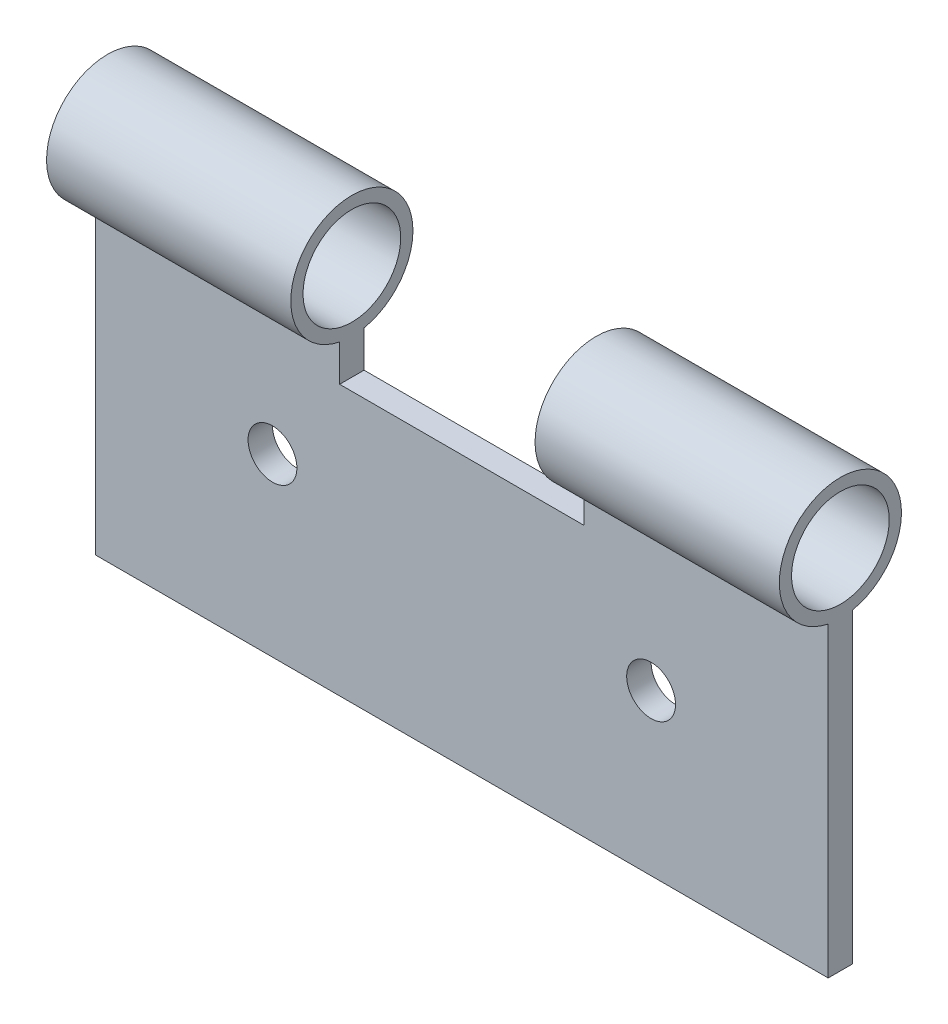
ISO-10303-21;
HEADER;
FILE_DESCRIPTION(('STEP AP214'),'2;1');
FILE_NAME('part.step','',(''),(''),'','','');
FILE_SCHEMA(('AUTOMOTIVE_DESIGN { 1 0 10303 214 1 1 1 1 }'));
ENDSEC;
DATA;
#1=APPLICATION_CONTEXT('core data for automotive mechanical design processes');
#2=APPLICATION_PROTOCOL_DEFINITION('international standard','automotive_design',2000,#1);
#3=PRODUCT_CONTEXT('',#1,'mechanical');
#4=PRODUCT('Part','Part','',(#3));
#5=PRODUCT_RELATED_PRODUCT_CATEGORY('part','',(#4));
#6=PRODUCT_DEFINITION_FORMATION('','',#4);
#7=PRODUCT_DEFINITION_CONTEXT('part definition',#1,'design');
#8=PRODUCT_DEFINITION('design','',#6,#7);
#9=PRODUCT_DEFINITION_SHAPE('','',#8);
#10=(LENGTH_UNIT() NAMED_UNIT(*) SI_UNIT(.MILLI.,.METRE.));
#11=(NAMED_UNIT(*) PLANE_ANGLE_UNIT() SI_UNIT($,.RADIAN.));
#12=(NAMED_UNIT(*) SI_UNIT($,.STERADIAN.) SOLID_ANGLE_UNIT());
#13=UNCERTAINTY_MEASURE_WITH_UNIT(LENGTH_MEASURE(1.E-05),#10,'distance_accuracy_value','');
#14=(GEOMETRIC_REPRESENTATION_CONTEXT(3) GLOBAL_UNCERTAINTY_ASSIGNED_CONTEXT((#13)) GLOBAL_UNIT_ASSIGNED_CONTEXT((#10,
#11,#12)) REPRESENTATION_CONTEXT('',''));
#15=CARTESIAN_POINT('',(0.,0.,0.));
#16=DIRECTION('',(0.,0.,1.));
#17=DIRECTION('',(1.,0.,0.));
#18=AXIS2_PLACEMENT_3D('',#15,#16,#17);
#19=CARTESIAN_POINT('',(3.,0.75,0.));
#20=DIRECTION('',(-1.,0.,0.));
#21=DIRECTION('',(0.,0.,1.));
#22=AXIS2_PLACEMENT_3D('',#19,#20,#21);
#23=CYLINDRICAL_SURFACE('',#22,0.25);
#24=CARTESIAN_POINT('',(2.,0.75,0.));
#25=DIRECTION('',(-1.,0.,0.));
#26=DIRECTION('',(0.,0.,1.));
#27=AXIS2_PLACEMENT_3D('',#24,#25,#26);
#28=CIRCLE('',#27,0.25);
#29=CARTESIAN_POINT('',(2.,0.505051025721682,0.0500000000000001));
#30=VERTEX_POINT('',#29);
#31=CARTESIAN_POINT('',(2.,0.505051025721682,-0.0499999999999999));
#32=VERTEX_POINT('',#31);
#33=EDGE_CURVE('E106',#30,#32,#28,.T.);
#34=ORIENTED_EDGE('',*,*,#33,.F.);
#35=DIRECTION('',(-1.,0.,0.));
#36=VECTOR('',#35,1.);
#37=CARTESIAN_POINT('',(3.,0.505051025721682,0.0500000000000001));
#38=LINE('',#37,#36);
#39=CARTESIAN_POINT('',(3.,0.505051025721682,0.0500000000000001));
#40=VERTEX_POINT('',#39);
#41=EDGE_CURVE('E162',#40,#30,#38,.T.);
#42=ORIENTED_EDGE('',*,*,#41,.F.);
#43=CARTESIAN_POINT('',(3.,0.75,0.));
#44=DIRECTION('',(1.,0.,0.));
#45=DIRECTION('',(0.,0.,-1.));
#46=AXIS2_PLACEMENT_3D('',#43,#44,#45);
#47=CIRCLE('',#46,0.25);
#48=CARTESIAN_POINT('',(3.,0.505051025721682,-0.0499999999999999));
#49=VERTEX_POINT('',#48);
#50=EDGE_CURVE('E83',#49,#40,#47,.T.);
#51=ORIENTED_EDGE('',*,*,#50,.F.);
#52=DIRECTION('',(-1.,0.,0.));
#53=VECTOR('',#52,1.);
#54=CARTESIAN_POINT('',(3.,0.505051025721682,-0.0499999999999999));
#55=LINE('',#54,#53);
#56=EDGE_CURVE('E38',#49,#32,#55,.T.);
#57=ORIENTED_EDGE('',*,*,#56,.T.);
#58=EDGE_LOOP('',(#34,#42,#51,#57));
#59=FACE_BOUND('',#58,.T.);
#60=ADVANCED_FACE('F30',(#59),#23,.T.);
#61=CARTESIAN_POINT('',(3.,0.75,0.));
#62=DIRECTION('',(-1.,0.,0.));
#63=DIRECTION('',(0.,0.,1.));
#64=AXIS2_PLACEMENT_3D('',#61,#62,#63);
#65=CYLINDRICAL_SURFACE('',#64,0.2);
#66=CARTESIAN_POINT('',(3.,0.75,0.));
#67=DIRECTION('',(1.,0.,0.));
#68=DIRECTION('',(0.,0.,-1.));
#69=AXIS2_PLACEMENT_3D('',#66,#67,#68);
#70=CIRCLE('',#69,0.2);
#71=CARTESIAN_POINT('',(3.,0.75,-0.2));
#72=VERTEX_POINT('',#71);
#73=EDGE_CURVE('E136',#72,#72,#70,.T.);
#74=ORIENTED_EDGE('',*,*,#73,.T.);
#75=EDGE_LOOP('',(#74));
#76=FACE_BOUND('',#75,.T.);
#77=CARTESIAN_POINT('',(2.,0.75,0.));
#78=DIRECTION('',(-1.,0.,0.));
#79=DIRECTION('',(0.,0.,1.));
#80=AXIS2_PLACEMENT_3D('',#77,#78,#79);
#81=CIRCLE('',#80,0.2);
#82=CARTESIAN_POINT('',(2.,0.75,0.2));
#83=VERTEX_POINT('',#82);
#84=EDGE_CURVE('E171',#83,#83,#81,.T.);
#85=ORIENTED_EDGE('',*,*,#84,.T.);
#86=EDGE_LOOP('',(#85));
#87=FACE_BOUND('',#86,.T.);
#88=ADVANCED_FACE('F207',(#76,#87),#65,.F.);
#89=CARTESIAN_POINT('',(3.,0.75,0.));
#90=DIRECTION('',(1.,0.,0.));
#91=DIRECTION('',(0.,0.,-1.));
#92=AXIS2_PLACEMENT_3D('',#89,#90,#91);
#93=PLANE('',#92);
#94=DIRECTION('',(0.,1.,0.));
#95=VECTOR('',#94,1.);
#96=CARTESIAN_POINT('',(3.,0.505051025721682,-0.0499999999999999));
#97=LINE('',#96,#95);
#98=CARTESIAN_POINT('',(3.,-0.75,-0.0500000000000001));
#99=VERTEX_POINT('',#98);
#100=EDGE_CURVE('E143',#99,#49,#97,.T.);
#101=ORIENTED_EDGE('',*,*,#100,.T.);
#102=ORIENTED_EDGE('',*,*,#50,.T.);
#103=DIRECTION('',(0.,-1.,0.));
#104=VECTOR('',#103,1.);
#105=CARTESIAN_POINT('',(3.,0.505051025721682,0.0500000000000001));
#106=LINE('',#105,#104);
#107=CARTESIAN_POINT('',(3.,-0.75,0.0499999999999999));
#108=VERTEX_POINT('',#107);
#109=EDGE_CURVE('E146',#40,#108,#106,.T.);
#110=ORIENTED_EDGE('',*,*,#109,.T.);
#111=DIRECTION('',(0.,0.,-1.));
#112=VECTOR('',#111,1.);
#113=CARTESIAN_POINT('',(3.,-0.75,0.0499999999999999));
#114=LINE('',#113,#112);
#115=EDGE_CURVE('E54',#108,#99,#114,.T.);
#116=ORIENTED_EDGE('',*,*,#115,.T.);
#117=EDGE_LOOP('',(#101,#102,#110,#116));
#118=FACE_BOUND('',#117,.T.);
#119=ORIENTED_EDGE('',*,*,#73,.F.);
#120=EDGE_LOOP('',(#119));
#121=FACE_BOUND('',#120,.T.);
#122=ADVANCED_FACE('F192',(#118,#121),#93,.T.);
#123=CARTESIAN_POINT('',(0.,0.75,0.));
#124=DIRECTION('',(1.,0.,0.));
#125=DIRECTION('',(0.,0.,-1.));
#126=AXIS2_PLACEMENT_3D('',#123,#124,#125);
#127=PLANE('',#126);
#128=DIRECTION('',(0.,1.,0.));
#129=VECTOR('',#128,1.);
#130=CARTESIAN_POINT('',(0.,0.505051025721682,-0.0499999999999999));
#131=LINE('',#130,#129);
#132=CARTESIAN_POINT('',(0.,-0.75,-0.0500000000000001));
#133=VERTEX_POINT('',#132);
#134=CARTESIAN_POINT('',(0.,0.505051025721682,-0.0499999999999999));
#135=VERTEX_POINT('',#134);
#136=EDGE_CURVE('E139',#133,#135,#131,.T.);
#137=ORIENTED_EDGE('',*,*,#136,.F.);
#138=DIRECTION('',(0.,0.,-1.));
#139=VECTOR('',#138,1.);
#140=CARTESIAN_POINT('',(0.,-0.75,0.0499999999999999));
#141=LINE('',#140,#139);
#142=CARTESIAN_POINT('',(0.,-0.75,0.0499999999999999));
#143=VERTEX_POINT('',#142);
#144=EDGE_CURVE('E75',#143,#133,#141,.T.);
#145=ORIENTED_EDGE('',*,*,#144,.F.);
#146=DIRECTION('',(0.,-1.,0.));
#147=VECTOR('',#146,1.);
#148=CARTESIAN_POINT('',(0.,0.505051025721682,0.0500000000000001));
#149=LINE('',#148,#147);
#150=CARTESIAN_POINT('',(0.,0.505051025721682,0.0500000000000001));
#151=VERTEX_POINT('',#150);
#152=EDGE_CURVE('E155',#151,#143,#149,.T.);
#153=ORIENTED_EDGE('',*,*,#152,.F.);
#154=CARTESIAN_POINT('',(0.,0.75,0.));
#155=DIRECTION('',(1.,0.,0.));
#156=DIRECTION('',(0.,0.,-1.));
#157=AXIS2_PLACEMENT_3D('',#154,#155,#156);
#158=CIRCLE('',#157,0.25);
#159=EDGE_CURVE('E152',#135,#151,#158,.T.);
#160=ORIENTED_EDGE('',*,*,#159,.F.);
#161=EDGE_LOOP('',(#137,#145,#153,#160));
#162=FACE_BOUND('',#161,.T.);
#163=CARTESIAN_POINT('',(0.,0.75,0.));
#164=DIRECTION('',(1.,0.,0.));
#165=DIRECTION('',(0.,0.,-1.));
#166=AXIS2_PLACEMENT_3D('',#163,#164,#165);
#167=CIRCLE('',#166,0.2);
#168=CARTESIAN_POINT('',(0.,0.75,-0.2));
#169=VERTEX_POINT('',#168);
#170=EDGE_CURVE('E140',#169,#169,#167,.T.);
#171=ORIENTED_EDGE('',*,*,#170,.T.);
#172=EDGE_LOOP('',(#171));
#173=FACE_BOUND('',#172,.T.);
#174=ADVANCED_FACE('F222',(#162,#173),#127,.F.);
#175=CARTESIAN_POINT('',(3.,0.505051025721682,-0.0499999999999999));
#176=DIRECTION('',(0.,0.,1.));
#177=DIRECTION('',(0.,-1.,0.));
#178=AXIS2_PLACEMENT_3D('',#175,#176,#177);
#179=PLANE('',#178);
#180=CARTESIAN_POINT('',(0.725,-0.0295980010586301,-0.05));
#181=DIRECTION('',(0.,0.,-1.));
#182=DIRECTION('',(0.,1.,0.));
#183=AXIS2_PLACEMENT_3D('',#180,#181,#182);
#184=CIRCLE('',#183,0.1);
#185=CARTESIAN_POINT('',(0.725,0.07040199894137,-0.05));
#186=VERTEX_POINT('',#185);
#187=EDGE_CURVE('E123',#186,#186,#184,.T.);
#188=ORIENTED_EDGE('',*,*,#187,.F.);
#189=EDGE_LOOP('',(#188));
#190=FACE_BOUND('',#189,.T.);
#191=CARTESIAN_POINT('',(2.275,-0.0928764860805288,-0.05));
#192=DIRECTION('',(0.,0.,-1.));
#193=DIRECTION('',(0.,1.,0.));
#194=AXIS2_PLACEMENT_3D('',#191,#192,#193);
#195=CIRCLE('',#194,0.0999999999999999);
#196=CARTESIAN_POINT('',(2.275,0.00712351391947105,-0.05));
#197=VERTEX_POINT('',#196);
#198=EDGE_CURVE('E132',#197,#197,#195,.T.);
#199=ORIENTED_EDGE('',*,*,#198,.F.);
#200=EDGE_LOOP('',(#199));
#201=FACE_BOUND('',#200,.T.);
#202=CARTESIAN_POINT('',(1.,0.505051025721682,-0.0499999999999999));
#203=VERTEX_POINT('',#202);
#204=EDGE_CURVE('E165',#203,#135,#55,.T.);
#205=ORIENTED_EDGE('',*,*,#204,.F.);
#206=DIRECTION('',(0.,-1.,0.));
#207=VECTOR('',#206,1.);
#208=CARTESIAN_POINT('',(1.,0.505051025721682,-0.0499999999999999));
#209=LINE('',#208,#207);
#210=CARTESIAN_POINT('',(1.,0.355051025721683,-0.0500000000000001));
#211=VERTEX_POINT('',#210);
#212=EDGE_CURVE('E122',#203,#211,#209,.T.);
#213=ORIENTED_EDGE('',*,*,#212,.T.);
#214=DIRECTION('',(1.,0.,0.));
#215=VECTOR('',#214,1.);
#216=CARTESIAN_POINT('',(3.,0.355051025721683,-0.05));
#217=LINE('',#216,#215);
#218=CARTESIAN_POINT('',(2.,0.355051025721683,-0.0500000000000001));
#219=VERTEX_POINT('',#218);
#220=EDGE_CURVE('E115',#211,#219,#217,.T.);
#221=ORIENTED_EDGE('',*,*,#220,.T.);
#222=DIRECTION('',(0.,-1.,0.));
#223=VECTOR('',#222,1.);
#224=CARTESIAN_POINT('',(2.,0.505051025721682,-0.0499999999999999));
#225=LINE('',#224,#223);
#226=EDGE_CURVE('E103',#32,#219,#225,.T.);
#227=ORIENTED_EDGE('',*,*,#226,.F.);
#228=ORIENTED_EDGE('',*,*,#56,.F.);
#229=ORIENTED_EDGE('',*,*,#100,.F.);
#230=DIRECTION('',(-1.,0.,0.));
#231=VECTOR('',#230,1.);
#232=CARTESIAN_POINT('',(3.,-0.75,-0.0500000000000001));
#233=LINE('',#232,#231);
#234=EDGE_CURVE('E149',#99,#133,#233,.T.);
#235=ORIENTED_EDGE('',*,*,#234,.T.);
#236=ORIENTED_EDGE('',*,*,#136,.T.);
#237=EDGE_LOOP('',(#205,#213,#221,#227,#228,#229,#235,#236));
#238=FACE_BOUND('',#237,.T.);
#239=ADVANCED_FACE('F32',(#190,#201,#238),#179,.F.);
#240=CARTESIAN_POINT('',(1.,0.505051025721682,0.0500000000000001));
#241=VERTEX_POINT('',#240);
#242=EDGE_CURVE('E161',#241,#151,#38,.T.);
#243=ORIENTED_EDGE('',*,*,#242,.F.);
#244=CARTESIAN_POINT('',(1.,0.75,0.));
#245=DIRECTION('',(-1.,0.,0.));
#246=DIRECTION('',(0.,0.,1.));
#247=AXIS2_PLACEMENT_3D('',#244,#245,#246);
#248=CIRCLE('',#247,0.25);
#249=EDGE_CURVE('E128',#241,#203,#248,.T.);
#250=ORIENTED_EDGE('',*,*,#249,.T.);
#251=ORIENTED_EDGE('',*,*,#204,.T.);
#252=ORIENTED_EDGE('',*,*,#159,.T.);
#253=EDGE_LOOP('',(#243,#250,#251,#252));
#254=FACE_BOUND('',#253,.T.);
#255=ADVANCED_FACE('F208',(#254),#23,.T.);
#256=CARTESIAN_POINT('',(3.,0.505051025721682,0.0500000000000001));
#257=DIRECTION('',(0.,0.,-1.));
#258=DIRECTION('',(0.,1.,0.));
#259=AXIS2_PLACEMENT_3D('',#256,#257,#258);
#260=PLANE('',#259);
#261=CARTESIAN_POINT('',(0.725,-0.0295980010586301,0.0500000000000001));
#262=DIRECTION('',(0.,0.,-1.));
#263=DIRECTION('',(0.,1.,0.));
#264=AXIS2_PLACEMENT_3D('',#261,#262,#263);
#265=CIRCLE('',#264,0.1);
#266=CARTESIAN_POINT('',(0.725,0.07040199894137,0.0500000000000001));
#267=VERTEX_POINT('',#266);
#268=EDGE_CURVE('E126',#267,#267,#265,.T.);
#269=ORIENTED_EDGE('',*,*,#268,.T.);
#270=EDGE_LOOP('',(#269));
#271=FACE_BOUND('',#270,.T.);
#272=CARTESIAN_POINT('',(2.275,-0.0928764860805289,0.0500000000000001));
#273=DIRECTION('',(0.,0.,-1.));
#274=DIRECTION('',(0.,1.,0.));
#275=AXIS2_PLACEMENT_3D('',#272,#273,#274);
#276=CIRCLE('',#275,0.0999999999999999);
#277=CARTESIAN_POINT('',(2.275,0.00712351391947103,0.0500000000000001));
#278=VERTEX_POINT('',#277);
#279=EDGE_CURVE('E135',#278,#278,#276,.T.);
#280=ORIENTED_EDGE('',*,*,#279,.T.);
#281=EDGE_LOOP('',(#280));
#282=FACE_BOUND('',#281,.T.);
#283=DIRECTION('',(-1.,0.,0.));
#284=VECTOR('',#283,1.);
#285=CARTESIAN_POINT('',(3.,0.355051025721683,0.0500000000000001));
#286=LINE('',#285,#284);
#287=CARTESIAN_POINT('',(2.,0.355051025721683,0.0500000000000001));
#288=VERTEX_POINT('',#287);
#289=CARTESIAN_POINT('',(1.,0.355051025721683,0.0500000000000001));
#290=VERTEX_POINT('',#289);
#291=EDGE_CURVE('E11',#288,#290,#286,.T.);
#292=ORIENTED_EDGE('',*,*,#291,.T.);
#293=DIRECTION('',(0.,1.,0.));
#294=VECTOR('',#293,1.);
#295=CARTESIAN_POINT('',(1.,0.505051025721682,0.0500000000000001));
#296=LINE('',#295,#294);
#297=EDGE_CURVE('E175',#290,#241,#296,.T.);
#298=ORIENTED_EDGE('',*,*,#297,.T.);
#299=ORIENTED_EDGE('',*,*,#242,.T.);
#300=ORIENTED_EDGE('',*,*,#152,.T.);
#301=DIRECTION('',(-1.,0.,0.));
#302=VECTOR('',#301,1.);
#303=CARTESIAN_POINT('',(3.,-0.75,0.0499999999999999));
#304=LINE('',#303,#302);
#305=EDGE_CURVE('E159',#108,#143,#304,.T.);
#306=ORIENTED_EDGE('',*,*,#305,.F.);
#307=ORIENTED_EDGE('',*,*,#109,.F.);
#308=ORIENTED_EDGE('',*,*,#41,.T.);
#309=DIRECTION('',(0.,1.,0.));
#310=VECTOR('',#309,1.);
#311=CARTESIAN_POINT('',(2.,0.505051025721682,0.0500000000000001));
#312=LINE('',#311,#310);
#313=EDGE_CURVE('E173',#288,#30,#312,.T.);
#314=ORIENTED_EDGE('',*,*,#313,.F.);
#315=EDGE_LOOP('',(#292,#298,#299,#300,#306,#307,#308,#314));
#316=FACE_BOUND('',#315,.T.);
#317=ADVANCED_FACE('F188',(#271,#282,#316),#260,.F.);
#318=CARTESIAN_POINT('',(3.,-0.75,0.0499999999999999));
#319=DIRECTION('',(0.,1.,0.));
#320=DIRECTION('',(0.,0.,1.));
#321=AXIS2_PLACEMENT_3D('',#318,#319,#320);
#322=PLANE('',#321);
#323=ORIENTED_EDGE('',*,*,#144,.T.);
#324=ORIENTED_EDGE('',*,*,#234,.F.);
#325=ORIENTED_EDGE('',*,*,#115,.F.);
#326=ORIENTED_EDGE('',*,*,#305,.T.);
#327=EDGE_LOOP('',(#323,#324,#325,#326));
#328=FACE_BOUND('',#327,.T.);
#329=ADVANCED_FACE('F196',(#328),#322,.F.);
#330=CARTESIAN_POINT('',(1.,0.75,0.));
#331=DIRECTION('',(-1.,0.,0.));
#332=DIRECTION('',(0.,0.,1.));
#333=AXIS2_PLACEMENT_3D('',#330,#331,#332);
#334=CIRCLE('',#333,0.2);
#335=CARTESIAN_POINT('',(1.,0.75,0.2));
#336=VERTEX_POINT('',#335);
#337=EDGE_CURVE('E110',#336,#336,#334,.T.);
#338=ORIENTED_EDGE('',*,*,#337,.F.);
#339=EDGE_LOOP('',(#338));
#340=FACE_BOUND('',#339,.T.);
#341=ORIENTED_EDGE('',*,*,#170,.F.);
#342=EDGE_LOOP('',(#341));
#343=FACE_BOUND('',#342,.T.);
#344=ADVANCED_FACE('F198',(#340,#343),#65,.F.);
#345=CARTESIAN_POINT('',(2.275,-0.0928764860805292,2.95));
#346=DIRECTION('',(0.,0.,-1.));
#347=DIRECTION('',(0.,1.,0.));
#348=AXIS2_PLACEMENT_3D('',#345,#346,#347);
#349=CYLINDRICAL_SURFACE('',#348,0.0999999999999999);
#350=ORIENTED_EDGE('',*,*,#198,.T.);
#351=EDGE_LOOP('',(#350));
#352=FACE_BOUND('',#351,.T.);
#353=ORIENTED_EDGE('',*,*,#279,.F.);
#354=EDGE_LOOP('',(#353));
#355=FACE_BOUND('',#354,.T.);
#356=ADVANCED_FACE('F204',(#352,#355),#349,.F.);
#357=CARTESIAN_POINT('',(0.725,-0.0295980010586304,2.95));
#358=DIRECTION('',(0.,0.,-1.));
#359=DIRECTION('',(0.,1.,0.));
#360=AXIS2_PLACEMENT_3D('',#357,#358,#359);
#361=CYLINDRICAL_SURFACE('',#360,0.1);
#362=ORIENTED_EDGE('',*,*,#187,.T.);
#363=EDGE_LOOP('',(#362));
#364=FACE_BOUND('',#363,.T.);
#365=ORIENTED_EDGE('',*,*,#268,.F.);
#366=EDGE_LOOP('',(#365));
#367=FACE_BOUND('',#366,.T.);
#368=ADVANCED_FACE('F237',(#364,#367),#361,.F.);
#369=CARTESIAN_POINT('',(1.3933316166658,0.355051025721683,3.05));
#370=DIRECTION('',(0.,-1.,0.));
#371=DIRECTION('',(1.,0.,0.));
#372=AXIS2_PLACEMENT_3D('',#369,#370,#371);
#373=PLANE('',#372);
#374=DIRECTION('',(0.,0.,-1.));
#375=VECTOR('',#374,1.);
#376=CARTESIAN_POINT('',(1.,0.355051025721683,3.05));
#377=LINE('',#376,#375);
#378=EDGE_CURVE('E118',#290,#211,#377,.T.);
#379=ORIENTED_EDGE('',*,*,#378,.F.);
#380=ORIENTED_EDGE('',*,*,#291,.F.);
#381=DIRECTION('',(0.,0.,-1.));
#382=VECTOR('',#381,1.);
#383=CARTESIAN_POINT('',(2.,0.355051025721683,3.05));
#384=LINE('',#383,#382);
#385=EDGE_CURVE('E45',#288,#219,#384,.T.);
#386=ORIENTED_EDGE('',*,*,#385,.T.);
#387=ORIENTED_EDGE('',*,*,#220,.F.);
#388=EDGE_LOOP('',(#379,#380,#386,#387));
#389=FACE_BOUND('',#388,.T.);
#390=ADVANCED_FACE('F114',(#389),#373,.F.);
#391=CARTESIAN_POINT('',(1.,-3.04569869859336,3.05));
#392=DIRECTION('',(-1.,0.,0.));
#393=DIRECTION('',(0.,0.,1.));
#394=AXIS2_PLACEMENT_3D('',#391,#392,#393);
#395=PLANE('',#394);
#396=ORIENTED_EDGE('',*,*,#337,.T.);
#397=EDGE_LOOP('',(#396));
#398=FACE_BOUND('',#397,.T.);
#399=ORIENTED_EDGE('',*,*,#249,.F.);
#400=ORIENTED_EDGE('',*,*,#297,.F.);
#401=ORIENTED_EDGE('',*,*,#378,.T.);
#402=ORIENTED_EDGE('',*,*,#212,.F.);
#403=EDGE_LOOP('',(#399,#400,#401,#402));
#404=FACE_BOUND('',#403,.T.);
#405=ADVANCED_FACE('F187',(#398,#404),#395,.F.);
#406=CARTESIAN_POINT('',(2.,-3.04569869859336,3.05));
#407=DIRECTION('',(-1.,0.,0.));
#408=DIRECTION('',(0.,0.,1.));
#409=AXIS2_PLACEMENT_3D('',#406,#407,#408);
#410=PLANE('',#409);
#411=ORIENTED_EDGE('',*,*,#84,.F.);
#412=EDGE_LOOP('',(#411));
#413=FACE_BOUND('',#412,.T.);
#414=ORIENTED_EDGE('',*,*,#226,.T.);
#415=ORIENTED_EDGE('',*,*,#385,.F.);
#416=ORIENTED_EDGE('',*,*,#313,.T.);
#417=ORIENTED_EDGE('',*,*,#33,.T.);
#418=EDGE_LOOP('',(#414,#415,#416,#417));
#419=FACE_BOUND('',#418,.T.);
#420=ADVANCED_FACE('F104',(#413,#419),#410,.T.);
#421=CLOSED_SHELL('',(#60,#88,#122,#174,#239,#255,#317,#329,#344,#356,#368,#390,#405,#420));
#422=MANIFOLD_SOLID_BREP('B2',#421);
#423=ADVANCED_BREP_SHAPE_REPRESENTATION('',(#18,#422),#14);
#424=SHAPE_DEFINITION_REPRESENTATION(#9,#423);
ENDSEC;
END-ISO-10303-21;
